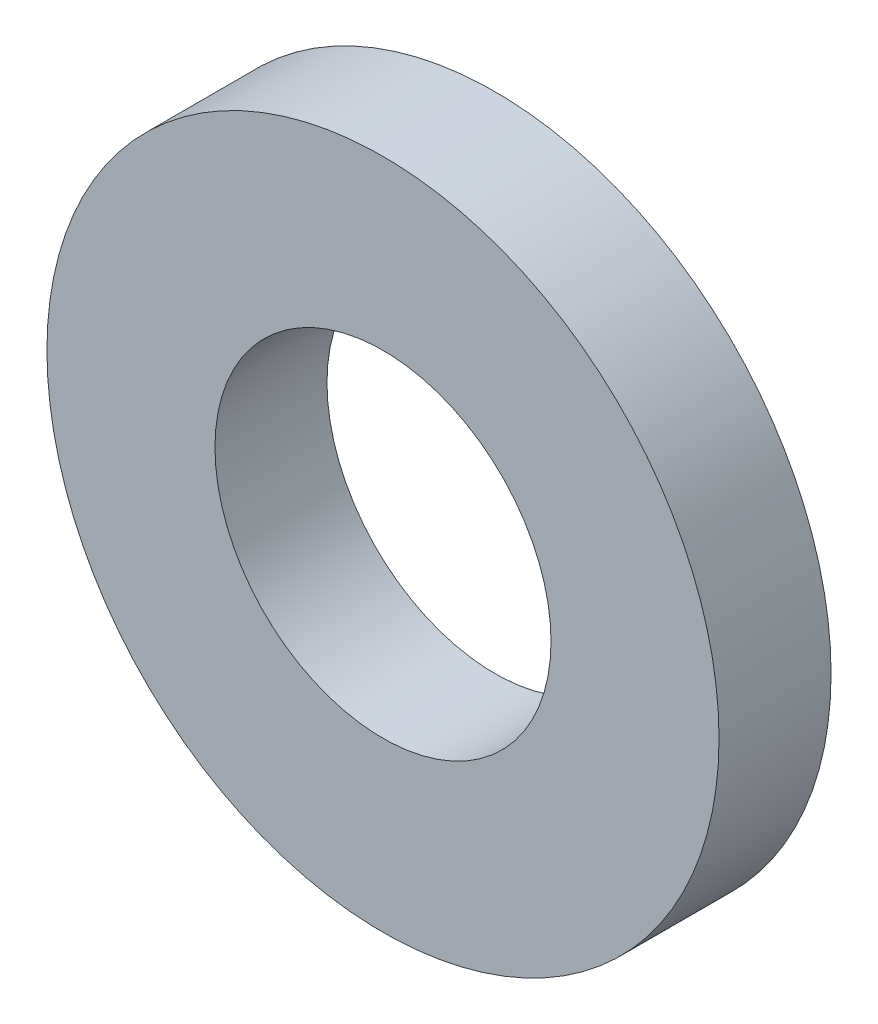
ISO-10303-21;
HEADER;
FILE_DESCRIPTION(('STEP AP214'),'2;1');
FILE_NAME('part.step','',(''),(''),'','','');
FILE_SCHEMA(('AUTOMOTIVE_DESIGN { 1 0 10303 214 1 1 1 1 }'));
ENDSEC;
DATA;
#1=APPLICATION_CONTEXT('core data for automotive mechanical design processes');
#2=APPLICATION_PROTOCOL_DEFINITION('international standard','automotive_design',2000,#1);
#3=PRODUCT_CONTEXT('',#1,'mechanical');
#4=PRODUCT('Part','Part','',(#3));
#5=PRODUCT_RELATED_PRODUCT_CATEGORY('part','',(#4));
#6=PRODUCT_DEFINITION_FORMATION('','',#4);
#7=PRODUCT_DEFINITION_CONTEXT('part definition',#1,'design');
#8=PRODUCT_DEFINITION('design','',#6,#7);
#9=PRODUCT_DEFINITION_SHAPE('','',#8);
#10=(LENGTH_UNIT() NAMED_UNIT(*) SI_UNIT(.MILLI.,.METRE.));
#11=(NAMED_UNIT(*) PLANE_ANGLE_UNIT() SI_UNIT($,.RADIAN.));
#12=(NAMED_UNIT(*) SI_UNIT($,.STERADIAN.) SOLID_ANGLE_UNIT());
#13=UNCERTAINTY_MEASURE_WITH_UNIT(LENGTH_MEASURE(1.E-05),#10,'distance_accuracy_value','');
#14=(GEOMETRIC_REPRESENTATION_CONTEXT(3) GLOBAL_UNCERTAINTY_ASSIGNED_CONTEXT((#13)) GLOBAL_UNIT_ASSIGNED_CONTEXT((#10,
#11,#12)) REPRESENTATION_CONTEXT('',''));
#15=CARTESIAN_POINT('',(0.,0.,0.));
#16=DIRECTION('',(0.,0.,1.));
#17=DIRECTION('',(1.,0.,0.));
#18=AXIS2_PLACEMENT_3D('',#15,#16,#17);
#19=CARTESIAN_POINT('',(0.,0.,1.));
#20=DIRECTION('',(0.,0.,1.));
#21=DIRECTION('',(1.,0.,0.));
#22=AXIS2_PLACEMENT_3D('',#19,#20,#21);
#23=PLANE('',#22);
#24=CARTESIAN_POINT('',(0.,0.,1.));
#25=DIRECTION('',(0.,0.,1.));
#26=DIRECTION('',(1.,0.,0.));
#27=AXIS2_PLACEMENT_3D('',#24,#25,#26);
#28=CIRCLE('',#27,3.);
#29=CARTESIAN_POINT('',(3.,0.,1.));
#30=VERTEX_POINT('',#29);
#31=EDGE_CURVE('E10',#30,#30,#28,.T.);
#32=ORIENTED_EDGE('',*,*,#31,.T.);
#33=EDGE_LOOP('',(#32));
#34=FACE_BOUND('',#33,.T.);
#35=CARTESIAN_POINT('',(0.,0.,1.));
#36=DIRECTION('',(0.,0.,1.));
#37=DIRECTION('',(1.,0.,0.));
#38=AXIS2_PLACEMENT_3D('',#35,#36,#37);
#39=CIRCLE('',#38,1.5);
#40=CARTESIAN_POINT('',(1.5,0.,1.));
#41=VERTEX_POINT('',#40);
#42=EDGE_CURVE('E42',#41,#41,#39,.T.);
#43=ORIENTED_EDGE('',*,*,#42,.F.);
#44=EDGE_LOOP('',(#43));
#45=FACE_BOUND('',#44,.T.);
#46=ADVANCED_FACE('F31',(#34,#45),#23,.T.);
#47=CARTESIAN_POINT('',(0.,0.,0.));
#48=DIRECTION('',(0.,0.,1.));
#49=DIRECTION('',(1.,0.,0.));
#50=AXIS2_PLACEMENT_3D('',#47,#48,#49);
#51=PLANE('',#50);
#52=CARTESIAN_POINT('',(0.,0.,0.));
#53=DIRECTION('',(0.,0.,1.));
#54=DIRECTION('',(1.,0.,0.));
#55=AXIS2_PLACEMENT_3D('',#52,#53,#54);
#56=CIRCLE('',#55,3.);
#57=CARTESIAN_POINT('',(3.,0.,0.));
#58=VERTEX_POINT('',#57);
#59=EDGE_CURVE('E35',#58,#58,#56,.T.);
#60=ORIENTED_EDGE('',*,*,#59,.F.);
#61=EDGE_LOOP('',(#60));
#62=FACE_BOUND('',#61,.T.);
#63=CARTESIAN_POINT('',(0.,0.,0.));
#64=DIRECTION('',(0.,0.,1.));
#65=DIRECTION('',(1.,0.,0.));
#66=AXIS2_PLACEMENT_3D('',#63,#64,#65);
#67=CIRCLE('',#66,1.5);
#68=CARTESIAN_POINT('',(1.5,0.,0.));
#69=VERTEX_POINT('',#68);
#70=EDGE_CURVE('E44',#69,#69,#67,.T.);
#71=ORIENTED_EDGE('',*,*,#70,.T.);
#72=EDGE_LOOP('',(#71));
#73=FACE_BOUND('',#72,.T.);
#74=ADVANCED_FACE('F54',(#62,#73),#51,.F.);
#75=CARTESIAN_POINT('',(0.,0.,1.));
#76=DIRECTION('',(0.,0.,-1.));
#77=DIRECTION('',(-1.,0.,0.));
#78=AXIS2_PLACEMENT_3D('',#75,#76,#77);
#79=CYLINDRICAL_SURFACE('',#78,3.);
#80=ORIENTED_EDGE('',*,*,#31,.F.);
#81=EDGE_LOOP('',(#80));
#82=FACE_BOUND('',#81,.T.);
#83=ORIENTED_EDGE('',*,*,#59,.T.);
#84=EDGE_LOOP('',(#83));
#85=FACE_BOUND('',#84,.T.);
#86=ADVANCED_FACE('F33',(#82,#85),#79,.T.);
#87=CARTESIAN_POINT('',(0.,0.,1.));
#88=DIRECTION('',(0.,0.,-1.));
#89=DIRECTION('',(-1.,0.,0.));
#90=AXIS2_PLACEMENT_3D('',#87,#88,#89);
#91=CYLINDRICAL_SURFACE('',#90,1.5);
#92=ORIENTED_EDGE('',*,*,#42,.T.);
#93=EDGE_LOOP('',(#92));
#94=FACE_BOUND('',#93,.T.);
#95=ORIENTED_EDGE('',*,*,#70,.F.);
#96=EDGE_LOOP('',(#95));
#97=FACE_BOUND('',#96,.T.);
#98=ADVANCED_FACE('F50',(#94,#97),#91,.F.);
#99=CLOSED_SHELL('',(#46,#74,#86,#98));
#100=MANIFOLD_SOLID_BREP('B2',#99);
#101=ADVANCED_BREP_SHAPE_REPRESENTATION('',(#18,#100),#14);
#102=SHAPE_DEFINITION_REPRESENTATION(#9,#101);
ENDSEC;
END-ISO-10303-21;
